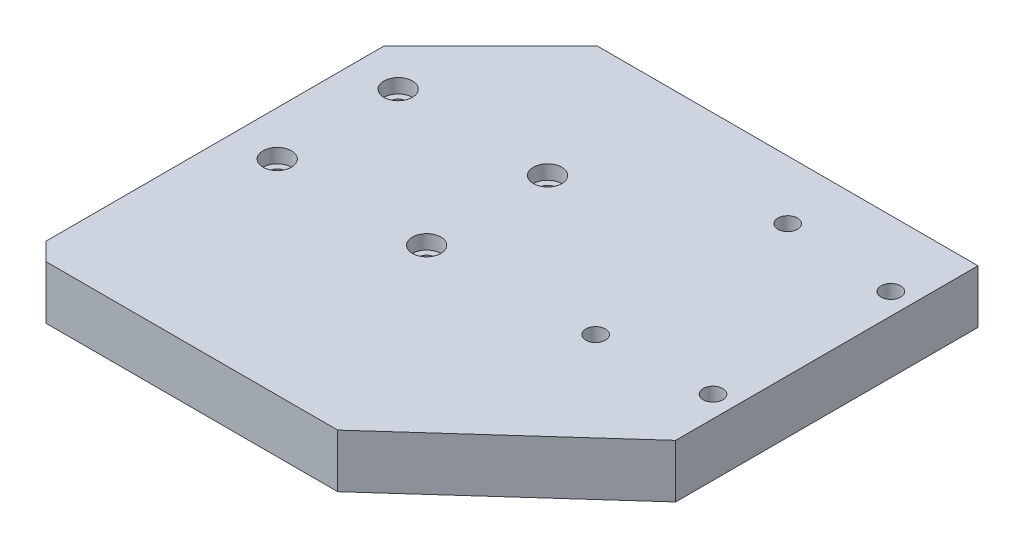
ISO-10303-21;
HEADER;
FILE_DESCRIPTION(('STEP AP214'),'2;1');
FILE_NAME('part.step','',(''),(''),'','','');
FILE_SCHEMA(('AUTOMOTIVE_DESIGN { 1 0 10303 214 1 1 1 1 }'));
ENDSEC;
DATA;
#1=APPLICATION_CONTEXT('core data for automotive mechanical design processes');
#2=APPLICATION_PROTOCOL_DEFINITION('international standard','automotive_design',2000,#1);
#3=PRODUCT_CONTEXT('',#1,'mechanical');
#4=PRODUCT('Part','Part','',(#3));
#5=PRODUCT_RELATED_PRODUCT_CATEGORY('part','',(#4));
#6=PRODUCT_DEFINITION_FORMATION('','',#4);
#7=PRODUCT_DEFINITION_CONTEXT('part definition',#1,'design');
#8=PRODUCT_DEFINITION('design','',#6,#7);
#9=PRODUCT_DEFINITION_SHAPE('','',#8);
#10=(LENGTH_UNIT() NAMED_UNIT(*) SI_UNIT(.MILLI.,.METRE.));
#11=(NAMED_UNIT(*) PLANE_ANGLE_UNIT() SI_UNIT($,.RADIAN.));
#12=(NAMED_UNIT(*) SI_UNIT($,.STERADIAN.) SOLID_ANGLE_UNIT());
#13=UNCERTAINTY_MEASURE_WITH_UNIT(LENGTH_MEASURE(1.E-05),#10,'distance_accuracy_value','');
#14=(GEOMETRIC_REPRESENTATION_CONTEXT(3) GLOBAL_UNCERTAINTY_ASSIGNED_CONTEXT((#13)) GLOBAL_UNIT_ASSIGNED_CONTEXT((#10,
#11,#12)) REPRESENTATION_CONTEXT('',''));
#15=CARTESIAN_POINT('',(0.,0.,0.));
#16=DIRECTION('',(0.,0.,1.));
#17=DIRECTION('',(1.,0.,0.));
#18=AXIS2_PLACEMENT_3D('',#15,#16,#17);
#19=CARTESIAN_POINT('',(0.,15.,-5.));
#20=DIRECTION('',(0.707106781186547,0.,-0.707106781186548));
#21=DIRECTION('',(-0.707106781186548,0.,-0.707106781186547));
#22=AXIS2_PLACEMENT_3D('',#19,#20,#21);
#23=PLANE('',#22);
#24=DIRECTION('',(0.707106781186548,0.,0.707106781186547));
#25=VECTOR('',#24,1.);
#26=CARTESIAN_POINT('',(0.,0.,-5.));
#27=LINE('',#26,#25);
#28=CARTESIAN_POINT('',(0.,0.,-5.));
#29=VERTEX_POINT('',#28);
#30=CARTESIAN_POINT('',(5.,0.,0.));
#31=VERTEX_POINT('',#30);
#32=EDGE_CURVE('E140',#29,#31,#27,.T.);
#33=ORIENTED_EDGE('',*,*,#32,.T.);
#34=DIRECTION('',(0.,-1.,0.));
#35=VECTOR('',#34,1.);
#36=CARTESIAN_POINT('',(5.,15.,0.));
#37=LINE('',#36,#35);
#38=CARTESIAN_POINT('',(5.,15.,0.));
#39=VERTEX_POINT('',#38);
#40=EDGE_CURVE('E11',#39,#31,#37,.T.);
#41=ORIENTED_EDGE('',*,*,#40,.F.);
#42=DIRECTION('',(0.707106781186548,0.,0.707106781186547));
#43=VECTOR('',#42,1.);
#44=CARTESIAN_POINT('',(0.,15.,-5.));
#45=LINE('',#44,#43);
#46=CARTESIAN_POINT('',(0.,15.,-5.));
#47=VERTEX_POINT('',#46);
#48=EDGE_CURVE('E154',#47,#39,#45,.T.);
#49=ORIENTED_EDGE('',*,*,#48,.F.);
#50=DIRECTION('',(0.,-1.,0.));
#51=VECTOR('',#50,1.);
#52=CARTESIAN_POINT('',(0.,15.,-5.));
#53=LINE('',#52,#51);
#54=EDGE_CURVE('E136',#47,#29,#53,.T.);
#55=ORIENTED_EDGE('',*,*,#54,.T.);
#56=EDGE_LOOP('',(#33,#41,#49,#55));
#57=FACE_BOUND('',#56,.T.);
#58=ADVANCED_FACE('F47',(#57),#23,.F.);
#59=CARTESIAN_POINT('',(5.,15.,0.));
#60=DIRECTION('',(0.,0.,-1.));
#61=DIRECTION('',(-1.,0.,0.));
#62=AXIS2_PLACEMENT_3D('',#59,#60,#61);
#63=PLANE('',#62);
#64=DIRECTION('',(1.,0.,0.));
#65=VECTOR('',#64,1.);
#66=CARTESIAN_POINT('',(5.,0.,0.));
#67=LINE('',#66,#65);
#68=CARTESIAN_POINT('',(87.,0.,0.));
#69=VERTEX_POINT('',#68);
#70=EDGE_CURVE('E143',#31,#69,#67,.T.);
#71=ORIENTED_EDGE('',*,*,#70,.T.);
#72=DIRECTION('',(0.,-1.,0.));
#73=VECTOR('',#72,1.);
#74=CARTESIAN_POINT('',(87.,15.,0.));
#75=LINE('',#74,#73);
#76=CARTESIAN_POINT('',(87.,15.,0.));
#77=VERTEX_POINT('',#76);
#78=EDGE_CURVE('E55',#77,#69,#75,.T.);
#79=ORIENTED_EDGE('',*,*,#78,.F.);
#80=DIRECTION('',(1.,0.,0.));
#81=VECTOR('',#80,1.);
#82=CARTESIAN_POINT('',(5.,15.,0.));
#83=LINE('',#82,#81);
#84=EDGE_CURVE('E104',#39,#77,#83,.T.);
#85=ORIENTED_EDGE('',*,*,#84,.F.);
#86=ORIENTED_EDGE('',*,*,#40,.T.);
#87=EDGE_LOOP('',(#71,#79,#85,#86));
#88=FACE_BOUND('',#87,.T.);
#89=ADVANCED_FACE('F286',(#88),#63,.F.);
#90=CARTESIAN_POINT('',(137.,15.,-45.));
#91=DIRECTION('',(-0.66896473162245,0.,-0.743294146247166));
#92=DIRECTION('',(-0.743294146247166,0.,0.66896473162245));
#93=AXIS2_PLACEMENT_3D('',#90,#91,#92);
#94=PLANE('',#93);
#95=DIRECTION('',(0.743294146247166,0.,-0.66896473162245));
#96=VECTOR('',#95,1.);
#97=CARTESIAN_POINT('',(137.,0.,-45.));
#98=LINE('',#97,#96);
#99=CARTESIAN_POINT('',(137.,0.,-45.));
#100=VERTEX_POINT('',#99);
#101=EDGE_CURVE('E146',#69,#100,#98,.T.);
#102=ORIENTED_EDGE('',*,*,#101,.T.);
#103=DIRECTION('',(0.,-1.,0.));
#104=VECTOR('',#103,1.);
#105=CARTESIAN_POINT('',(137.,15.,-45.));
#106=LINE('',#105,#104);
#107=CARTESIAN_POINT('',(137.,15.,-45.));
#108=VERTEX_POINT('',#107);
#109=EDGE_CURVE('E158',#108,#100,#106,.T.);
#110=ORIENTED_EDGE('',*,*,#109,.F.);
#111=DIRECTION('',(0.743294146247166,0.,-0.66896473162245));
#112=VECTOR('',#111,1.);
#113=CARTESIAN_POINT('',(137.,15.,-45.));
#114=LINE('',#113,#112);
#115=EDGE_CURVE('E166',#77,#108,#114,.T.);
#116=ORIENTED_EDGE('',*,*,#115,.F.);
#117=ORIENTED_EDGE('',*,*,#78,.T.);
#118=EDGE_LOOP('',(#102,#110,#116,#117));
#119=FACE_BOUND('',#118,.T.);
#120=ADVANCED_FACE('F164',(#119),#94,.F.);
#121=CARTESIAN_POINT('',(137.,15.,-130.));
#122=DIRECTION('',(-1.,0.,0.));
#123=DIRECTION('',(0.,0.,1.));
#124=AXIS2_PLACEMENT_3D('',#121,#122,#123);
#125=PLANE('',#124);
#126=DIRECTION('',(0.,0.,-1.));
#127=VECTOR('',#126,1.);
#128=CARTESIAN_POINT('',(137.,0.,-130.));
#129=LINE('',#128,#127);
#130=CARTESIAN_POINT('',(137.,0.,-130.));
#131=VERTEX_POINT('',#130);
#132=EDGE_CURVE('E149',#100,#131,#129,.T.);
#133=ORIENTED_EDGE('',*,*,#132,.T.);
#134=DIRECTION('',(0.,-1.,0.));
#135=VECTOR('',#134,1.);
#136=CARTESIAN_POINT('',(137.,15.,-130.));
#137=LINE('',#136,#135);
#138=CARTESIAN_POINT('',(137.,15.,-130.));
#139=VERTEX_POINT('',#138);
#140=EDGE_CURVE('E131',#139,#131,#137,.T.);
#141=ORIENTED_EDGE('',*,*,#140,.F.);
#142=DIRECTION('',(0.,0.,-1.));
#143=VECTOR('',#142,1.);
#144=CARTESIAN_POINT('',(137.,15.,-45.));
#145=LINE('',#144,#143);
#146=EDGE_CURVE('E122',#108,#139,#145,.T.);
#147=ORIENTED_EDGE('',*,*,#146,.F.);
#148=ORIENTED_EDGE('',*,*,#109,.T.);
#149=EDGE_LOOP('',(#133,#141,#147,#148));
#150=FACE_BOUND('',#149,.T.);
#151=ADVANCED_FACE('F171',(#150),#125,.F.);
#152=CARTESIAN_POINT('',(30.,15.,-130.));
#153=DIRECTION('',(0.,0.,1.));
#154=DIRECTION('',(1.,0.,0.));
#155=AXIS2_PLACEMENT_3D('',#152,#153,#154);
#156=PLANE('',#155);
#157=DIRECTION('',(-1.,0.,0.));
#158=VECTOR('',#157,1.);
#159=CARTESIAN_POINT('',(30.,0.,-130.));
#160=LINE('',#159,#158);
#161=CARTESIAN_POINT('',(30.,0.,-130.));
#162=VERTEX_POINT('',#161);
#163=EDGE_CURVE('E130',#131,#162,#160,.T.);
#164=ORIENTED_EDGE('',*,*,#163,.T.);
#165=DIRECTION('',(0.,-1.,0.));
#166=VECTOR('',#165,1.);
#167=CARTESIAN_POINT('',(30.,15.,-130.));
#168=LINE('',#167,#166);
#169=CARTESIAN_POINT('',(30.,15.,-130.));
#170=VERTEX_POINT('',#169);
#171=EDGE_CURVE('E127',#170,#162,#168,.T.);
#172=ORIENTED_EDGE('',*,*,#171,.F.);
#173=DIRECTION('',(-1.,0.,0.));
#174=VECTOR('',#173,1.);
#175=CARTESIAN_POINT('',(30.,15.,-130.));
#176=LINE('',#175,#174);
#177=EDGE_CURVE('E116',#139,#170,#176,.T.);
#178=ORIENTED_EDGE('',*,*,#177,.F.);
#179=ORIENTED_EDGE('',*,*,#140,.T.);
#180=EDGE_LOOP('',(#164,#172,#178,#179));
#181=FACE_BOUND('',#180,.T.);
#182=ADVANCED_FACE('F128',(#181),#156,.F.);
#183=CARTESIAN_POINT('',(0.,15.,-100.));
#184=DIRECTION('',(0.707106781186547,0.,0.707106781186547));
#185=DIRECTION('',(0.707106781186548,0.,-0.707106781186548));
#186=AXIS2_PLACEMENT_3D('',#183,#184,#185);
#187=PLANE('',#186);
#188=DIRECTION('',(-0.707106781186547,0.,0.707106781186547));
#189=VECTOR('',#188,1.);
#190=CARTESIAN_POINT('',(0.,0.,-100.));
#191=LINE('',#190,#189);
#192=CARTESIAN_POINT('',(0.,0.,-100.));
#193=VERTEX_POINT('',#192);
#194=EDGE_CURVE('E90',#162,#193,#191,.T.);
#195=ORIENTED_EDGE('',*,*,#194,.T.);
#196=DIRECTION('',(0.,-1.,0.));
#197=VECTOR('',#196,1.);
#198=CARTESIAN_POINT('',(0.,15.,-100.));
#199=LINE('',#198,#197);
#200=CARTESIAN_POINT('',(0.,15.,-100.));
#201=VERTEX_POINT('',#200);
#202=EDGE_CURVE('E132',#201,#193,#199,.T.);
#203=ORIENTED_EDGE('',*,*,#202,.F.);
#204=DIRECTION('',(-0.707106781186547,0.,0.707106781186547));
#205=VECTOR('',#204,1.);
#206=CARTESIAN_POINT('',(0.,15.,-100.));
#207=LINE('',#206,#205);
#208=EDGE_CURVE('E120',#170,#201,#207,.T.);
#209=ORIENTED_EDGE('',*,*,#208,.F.);
#210=ORIENTED_EDGE('',*,*,#171,.T.);
#211=EDGE_LOOP('',(#195,#203,#209,#210));
#212=FACE_BOUND('',#211,.T.);
#213=ADVANCED_FACE('F134',(#212),#187,.F.);
#214=CARTESIAN_POINT('',(0.,15.,-5.));
#215=DIRECTION('',(1.,0.,0.));
#216=DIRECTION('',(0.,0.,-1.));
#217=AXIS2_PLACEMENT_3D('',#214,#215,#216);
#218=PLANE('',#217);
#219=CARTESIAN_POINT('',(0.,7.5,-50.));
#220=DIRECTION('',(-1.,0.,0.));
#221=DIRECTION('',(0.,0.,1.));
#222=AXIS2_PLACEMENT_3D('',#219,#220,#221);
#223=CIRCLE('',#222,2.09999999999999);
#224=CARTESIAN_POINT('',(0.,7.5,-47.9));
#225=VERTEX_POINT('',#224);
#226=EDGE_CURVE('E256',#225,#225,#223,.T.);
#227=ORIENTED_EDGE('',*,*,#226,.F.);
#228=EDGE_LOOP('',(#227));
#229=FACE_BOUND('',#228,.T.);
#230=CARTESIAN_POINT('',(0.,7.5,-20.));
#231=DIRECTION('',(-1.,0.,0.));
#232=DIRECTION('',(0.,0.,1.));
#233=AXIS2_PLACEMENT_3D('',#230,#231,#232);
#234=CIRCLE('',#233,2.09999999999999);
#235=CARTESIAN_POINT('',(0.,7.5,-17.9));
#236=VERTEX_POINT('',#235);
#237=EDGE_CURVE('E250',#236,#236,#234,.T.);
#238=ORIENTED_EDGE('',*,*,#237,.F.);
#239=EDGE_LOOP('',(#238));
#240=FACE_BOUND('',#239,.T.);
#241=DIRECTION('',(0.,0.,1.));
#242=VECTOR('',#241,1.);
#243=CARTESIAN_POINT('',(0.,0.,-5.));
#244=LINE('',#243,#242);
#245=EDGE_CURVE('E96',#193,#29,#244,.T.);
#246=ORIENTED_EDGE('',*,*,#245,.T.);
#247=ORIENTED_EDGE('',*,*,#54,.F.);
#248=DIRECTION('',(0.,0.,1.));
#249=VECTOR('',#248,1.);
#250=CARTESIAN_POINT('',(0.,15.,-5.));
#251=LINE('',#250,#249);
#252=EDGE_CURVE('E63',#201,#47,#251,.T.);
#253=ORIENTED_EDGE('',*,*,#252,.F.);
#254=ORIENTED_EDGE('',*,*,#202,.T.);
#255=EDGE_LOOP('',(#246,#247,#253,#254));
#256=FACE_BOUND('',#255,.T.);
#257=ADVANCED_FACE('F262',(#229,#240,#256),#218,.F.);
#258=CARTESIAN_POINT('',(-47.5,15.,-52.5));
#259=DIRECTION('',(0.,1.,0.));
#260=DIRECTION('',(0.,0.,1.));
#261=AXIS2_PLACEMENT_3D('',#258,#259,#260);
#262=PLANE('',#261);
#263=CARTESIAN_POINT('',(12.5,15.,-91.5));
#264=DIRECTION('',(0.,1.,0.));
#265=DIRECTION('',(0.,0.,1.));
#266=AXIS2_PLACEMENT_3D('',#263,#264,#265);
#267=CIRCLE('',#266,4.);
#268=CARTESIAN_POINT('',(12.5,15.,-87.5));
#269=VERTEX_POINT('',#268);
#270=EDGE_CURVE('E244',#269,#269,#267,.T.);
#271=ORIENTED_EDGE('',*,*,#270,.F.);
#272=EDGE_LOOP('',(#271));
#273=FACE_BOUND('',#272,.T.);
#274=CARTESIAN_POINT('',(12.5,15.,-57.5));
#275=DIRECTION('',(0.,1.,0.));
#276=DIRECTION('',(0.,0.,1.));
#277=AXIS2_PLACEMENT_3D('',#274,#275,#276);
#278=CIRCLE('',#277,4.);
#279=CARTESIAN_POINT('',(12.5,15.,-53.5));
#280=VERTEX_POINT('',#279);
#281=EDGE_CURVE('E232',#280,#280,#278,.T.);
#282=ORIENTED_EDGE('',*,*,#281,.F.);
#283=EDGE_LOOP('',(#282));
#284=FACE_BOUND('',#283,.T.);
#285=CARTESIAN_POINT('',(54.5,15.,-57.5));
#286=DIRECTION('',(0.,1.,0.));
#287=DIRECTION('',(0.,0.,1.));
#288=AXIS2_PLACEMENT_3D('',#285,#286,#287);
#289=CIRCLE('',#288,4.);
#290=CARTESIAN_POINT('',(54.5,15.,-53.5));
#291=VERTEX_POINT('',#290);
#292=EDGE_CURVE('E220',#291,#291,#289,.T.);
#293=ORIENTED_EDGE('',*,*,#292,.F.);
#294=EDGE_LOOP('',(#293));
#295=FACE_BOUND('',#294,.T.);
#296=CARTESIAN_POINT('',(54.5,15.,-91.5));
#297=DIRECTION('',(0.,1.,0.));
#298=DIRECTION('',(0.,0.,1.));
#299=AXIS2_PLACEMENT_3D('',#296,#297,#298);
#300=CIRCLE('',#299,4.);
#301=CARTESIAN_POINT('',(54.5,15.,-87.5));
#302=VERTEX_POINT('',#301);
#303=EDGE_CURVE('E208',#302,#302,#300,.T.);
#304=ORIENTED_EDGE('',*,*,#303,.F.);
#305=EDGE_LOOP('',(#304));
#306=FACE_BOUND('',#305,.T.);
#307=CARTESIAN_POINT('',(131.,15.,-111.5));
#308=DIRECTION('',(0.,1.,0.));
#309=DIRECTION('',(0.,0.,1.));
#310=AXIS2_PLACEMENT_3D('',#307,#308,#309);
#311=CIRCLE('',#310,2.75);
#312=CARTESIAN_POINT('',(131.,15.,-108.75));
#313=VERTEX_POINT('',#312);
#314=EDGE_CURVE('E196',#313,#313,#311,.T.);
#315=ORIENTED_EDGE('',*,*,#314,.F.);
#316=EDGE_LOOP('',(#315));
#317=FACE_BOUND('',#316,.T.);
#318=CARTESIAN_POINT('',(131.,15.,-61.5));
#319=DIRECTION('',(0.,1.,0.));
#320=DIRECTION('',(0.,0.,1.));
#321=AXIS2_PLACEMENT_3D('',#318,#319,#320);
#322=CIRCLE('',#321,2.75);
#323=CARTESIAN_POINT('',(131.,15.,-58.75));
#324=VERTEX_POINT('',#323);
#325=EDGE_CURVE('E190',#324,#324,#322,.T.);
#326=ORIENTED_EDGE('',*,*,#325,.F.);
#327=EDGE_LOOP('',(#326));
#328=FACE_BOUND('',#327,.T.);
#329=CARTESIAN_POINT('',(100.,15.,-59.5));
#330=DIRECTION('',(0.,1.,0.));
#331=DIRECTION('',(0.,0.,1.));
#332=AXIS2_PLACEMENT_3D('',#329,#330,#331);
#333=CIRCLE('',#332,2.75);
#334=CARTESIAN_POINT('',(100.,15.,-56.75));
#335=VERTEX_POINT('',#334);
#336=EDGE_CURVE('E184',#335,#335,#333,.T.);
#337=ORIENTED_EDGE('',*,*,#336,.F.);
#338=EDGE_LOOP('',(#337));
#339=FACE_BOUND('',#338,.T.);
#340=CARTESIAN_POINT('',(99.9999999999994,15.,-113.5));
#341=DIRECTION('',(0.,1.,0.));
#342=DIRECTION('',(0.,0.,1.));
#343=AXIS2_PLACEMENT_3D('',#340,#341,#342);
#344=CIRCLE('',#343,2.75);
#345=CARTESIAN_POINT('',(99.9999999999994,15.,-110.75));
#346=VERTEX_POINT('',#345);
#347=EDGE_CURVE('E178',#346,#346,#344,.T.);
#348=ORIENTED_EDGE('',*,*,#347,.F.);
#349=EDGE_LOOP('',(#348));
#350=FACE_BOUND('',#349,.T.);
#351=ORIENTED_EDGE('',*,*,#48,.T.);
#352=ORIENTED_EDGE('',*,*,#84,.T.);
#353=ORIENTED_EDGE('',*,*,#115,.T.);
#354=ORIENTED_EDGE('',*,*,#146,.T.);
#355=ORIENTED_EDGE('',*,*,#177,.T.);
#356=ORIENTED_EDGE('',*,*,#208,.T.);
#357=ORIENTED_EDGE('',*,*,#252,.T.);
#358=EDGE_LOOP('',(#351,#352,#353,#354,#355,#356,#357));
#359=FACE_BOUND('',#358,.T.);
#360=ADVANCED_FACE('F118',(#273,#284,#295,#306,#317,#328,#339,#350,#359),#262,.T.);
#361=CARTESIAN_POINT('',(-47.5,0.,-52.5));
#362=DIRECTION('',(0.,1.,0.));
#363=DIRECTION('',(0.,0.,1.));
#364=AXIS2_PLACEMENT_3D('',#361,#362,#363);
#365=PLANE('',#364);
#366=CARTESIAN_POINT('',(12.5,0.,-91.5));
#367=DIRECTION('',(0.,1.,0.));
#368=DIRECTION('',(0.,0.,1.));
#369=AXIS2_PLACEMENT_3D('',#366,#367,#368);
#370=CIRCLE('',#369,2.25);
#371=CARTESIAN_POINT('',(12.5,0.,-89.25));
#372=VERTEX_POINT('',#371);
#373=EDGE_CURVE('E235',#372,#372,#370,.T.);
#374=ORIENTED_EDGE('',*,*,#373,.T.);
#375=EDGE_LOOP('',(#374));
#376=FACE_BOUND('',#375,.T.);
#377=CARTESIAN_POINT('',(12.5,0.,-57.5));
#378=DIRECTION('',(0.,1.,0.));
#379=DIRECTION('',(0.,0.,1.));
#380=AXIS2_PLACEMENT_3D('',#377,#378,#379);
#381=CIRCLE('',#380,2.25);
#382=CARTESIAN_POINT('',(12.5,0.,-55.25));
#383=VERTEX_POINT('',#382);
#384=EDGE_CURVE('E223',#383,#383,#381,.T.);
#385=ORIENTED_EDGE('',*,*,#384,.T.);
#386=EDGE_LOOP('',(#385));
#387=FACE_BOUND('',#386,.T.);
#388=CARTESIAN_POINT('',(54.5,0.,-57.5));
#389=DIRECTION('',(0.,1.,0.));
#390=DIRECTION('',(0.,0.,1.));
#391=AXIS2_PLACEMENT_3D('',#388,#389,#390);
#392=CIRCLE('',#391,2.25);
#393=CARTESIAN_POINT('',(54.5,0.,-55.25));
#394=VERTEX_POINT('',#393);
#395=EDGE_CURVE('E211',#394,#394,#392,.T.);
#396=ORIENTED_EDGE('',*,*,#395,.T.);
#397=EDGE_LOOP('',(#396));
#398=FACE_BOUND('',#397,.T.);
#399=CARTESIAN_POINT('',(54.5,0.,-91.5));
#400=DIRECTION('',(0.,1.,0.));
#401=DIRECTION('',(0.,0.,1.));
#402=AXIS2_PLACEMENT_3D('',#399,#400,#401);
#403=CIRCLE('',#402,2.25);
#404=CARTESIAN_POINT('',(54.5,0.,-89.25));
#405=VERTEX_POINT('',#404);
#406=EDGE_CURVE('E199',#405,#405,#403,.T.);
#407=ORIENTED_EDGE('',*,*,#406,.T.);
#408=EDGE_LOOP('',(#407));
#409=FACE_BOUND('',#408,.T.);
#410=CARTESIAN_POINT('',(131.,0.,-111.5));
#411=DIRECTION('',(0.,1.,0.));
#412=DIRECTION('',(0.,0.,1.));
#413=AXIS2_PLACEMENT_3D('',#410,#411,#412);
#414=CIRCLE('',#413,2.75);
#415=CARTESIAN_POINT('',(131.,0.,-108.75));
#416=VERTEX_POINT('',#415);
#417=EDGE_CURVE('E193',#416,#416,#414,.T.);
#418=ORIENTED_EDGE('',*,*,#417,.T.);
#419=EDGE_LOOP('',(#418));
#420=FACE_BOUND('',#419,.T.);
#421=CARTESIAN_POINT('',(131.,0.,-61.5));
#422=DIRECTION('',(0.,1.,0.));
#423=DIRECTION('',(0.,0.,1.));
#424=AXIS2_PLACEMENT_3D('',#421,#422,#423);
#425=CIRCLE('',#424,2.75);
#426=CARTESIAN_POINT('',(131.,0.,-58.75));
#427=VERTEX_POINT('',#426);
#428=EDGE_CURVE('E187',#427,#427,#425,.T.);
#429=ORIENTED_EDGE('',*,*,#428,.T.);
#430=EDGE_LOOP('',(#429));
#431=FACE_BOUND('',#430,.T.);
#432=CARTESIAN_POINT('',(100.,0.,-59.5));
#433=DIRECTION('',(0.,1.,0.));
#434=DIRECTION('',(0.,0.,1.));
#435=AXIS2_PLACEMENT_3D('',#432,#433,#434);
#436=CIRCLE('',#435,2.75);
#437=CARTESIAN_POINT('',(100.,0.,-56.75));
#438=VERTEX_POINT('',#437);
#439=EDGE_CURVE('E181',#438,#438,#436,.T.);
#440=ORIENTED_EDGE('',*,*,#439,.T.);
#441=EDGE_LOOP('',(#440));
#442=FACE_BOUND('',#441,.T.);
#443=CARTESIAN_POINT('',(99.9999999999994,0.,-113.5));
#444=DIRECTION('',(0.,1.,0.));
#445=DIRECTION('',(0.,0.,1.));
#446=AXIS2_PLACEMENT_3D('',#443,#444,#445);
#447=CIRCLE('',#446,2.75);
#448=CARTESIAN_POINT('',(99.9999999999994,0.,-110.75));
#449=VERTEX_POINT('',#448);
#450=EDGE_CURVE('E144',#449,#449,#447,.T.);
#451=ORIENTED_EDGE('',*,*,#450,.T.);
#452=EDGE_LOOP('',(#451));
#453=FACE_BOUND('',#452,.T.);
#454=ORIENTED_EDGE('',*,*,#32,.F.);
#455=ORIENTED_EDGE('',*,*,#245,.F.);
#456=ORIENTED_EDGE('',*,*,#194,.F.);
#457=ORIENTED_EDGE('',*,*,#163,.F.);
#458=ORIENTED_EDGE('',*,*,#132,.F.);
#459=ORIENTED_EDGE('',*,*,#101,.F.);
#460=ORIENTED_EDGE('',*,*,#70,.F.);
#461=EDGE_LOOP('',(#454,#455,#456,#457,#458,#459,#460));
#462=FACE_BOUND('',#461,.T.);
#463=ADVANCED_FACE('F169',(#376,#387,#398,#409,#420,#431,#442,#453,#462),#365,.F.);
#464=CARTESIAN_POINT('',(99.9999999999994,15.,-113.5));
#465=DIRECTION('',(0.,1.,0.));
#466=DIRECTION('',(0.,0.,1.));
#467=AXIS2_PLACEMENT_3D('',#464,#465,#466);
#468=CYLINDRICAL_SURFACE('',#467,2.75);
#469=ORIENTED_EDGE('',*,*,#450,.F.);
#470=EDGE_LOOP('',(#469));
#471=FACE_BOUND('',#470,.T.);
#472=ORIENTED_EDGE('',*,*,#347,.T.);
#473=EDGE_LOOP('',(#472));
#474=FACE_BOUND('',#473,.T.);
#475=ADVANCED_FACE('F306',(#471,#474),#468,.F.);
#476=CARTESIAN_POINT('',(100.,15.,-59.5));
#477=DIRECTION('',(0.,1.,0.));
#478=DIRECTION('',(0.,0.,1.));
#479=AXIS2_PLACEMENT_3D('',#476,#477,#478);
#480=CYLINDRICAL_SURFACE('',#479,2.75);
#481=ORIENTED_EDGE('',*,*,#439,.F.);
#482=EDGE_LOOP('',(#481));
#483=FACE_BOUND('',#482,.T.);
#484=ORIENTED_EDGE('',*,*,#336,.T.);
#485=EDGE_LOOP('',(#484));
#486=FACE_BOUND('',#485,.T.);
#487=ADVANCED_FACE('F313',(#483,#486),#480,.F.);
#488=CARTESIAN_POINT('',(131.,15.,-61.5));
#489=DIRECTION('',(0.,1.,0.));
#490=DIRECTION('',(0.,0.,1.));
#491=AXIS2_PLACEMENT_3D('',#488,#489,#490);
#492=CYLINDRICAL_SURFACE('',#491,2.75);
#493=ORIENTED_EDGE('',*,*,#428,.F.);
#494=EDGE_LOOP('',(#493));
#495=FACE_BOUND('',#494,.T.);
#496=ORIENTED_EDGE('',*,*,#325,.T.);
#497=EDGE_LOOP('',(#496));
#498=FACE_BOUND('',#497,.T.);
#499=ADVANCED_FACE('F317',(#495,#498),#492,.F.);
#500=CARTESIAN_POINT('',(131.,15.,-111.5));
#501=DIRECTION('',(0.,1.,0.));
#502=DIRECTION('',(0.,0.,1.));
#503=AXIS2_PLACEMENT_3D('',#500,#501,#502);
#504=CYLINDRICAL_SURFACE('',#503,2.75);
#505=ORIENTED_EDGE('',*,*,#417,.F.);
#506=EDGE_LOOP('',(#505));
#507=FACE_BOUND('',#506,.T.);
#508=ORIENTED_EDGE('',*,*,#314,.T.);
#509=EDGE_LOOP('',(#508));
#510=FACE_BOUND('',#509,.T.);
#511=ADVANCED_FACE('F321',(#507,#510),#504,.F.);
#512=CARTESIAN_POINT('',(54.5,15.,-91.5));
#513=DIRECTION('',(0.,1.,0.));
#514=DIRECTION('',(0.,0.,1.));
#515=AXIS2_PLACEMENT_3D('',#512,#513,#514);
#516=CYLINDRICAL_SURFACE('',#515,2.25);
#517=ORIENTED_EDGE('',*,*,#406,.F.);
#518=EDGE_LOOP('',(#517));
#519=FACE_BOUND('',#518,.T.);
#520=CARTESIAN_POINT('',(54.5,11.,-91.5));
#521=DIRECTION('',(0.,1.,0.));
#522=DIRECTION('',(0.,0.,1.));
#523=AXIS2_PLACEMENT_3D('',#520,#521,#522);
#524=CIRCLE('',#523,2.25);
#525=CARTESIAN_POINT('',(54.5,11.,-89.25));
#526=VERTEX_POINT('',#525);
#527=EDGE_CURVE('E202',#526,#526,#524,.T.);
#528=ORIENTED_EDGE('',*,*,#527,.T.);
#529=EDGE_LOOP('',(#528));
#530=FACE_BOUND('',#529,.T.);
#531=ADVANCED_FACE('F325',(#519,#530),#516,.F.);
#532=CARTESIAN_POINT('',(56.75,11.,-91.5));
#533=DIRECTION('',(0.,-1.,0.));
#534=DIRECTION('',(0.,0.,-1.));
#535=AXIS2_PLACEMENT_3D('',#532,#533,#534);
#536=PLANE('',#535);
#537=ORIENTED_EDGE('',*,*,#527,.F.);
#538=EDGE_LOOP('',(#537));
#539=FACE_BOUND('',#538,.T.);
#540=CARTESIAN_POINT('',(54.5,11.,-91.5));
#541=DIRECTION('',(0.,1.,0.));
#542=DIRECTION('',(0.,0.,1.));
#543=AXIS2_PLACEMENT_3D('',#540,#541,#542);
#544=CIRCLE('',#543,4.);
#545=CARTESIAN_POINT('',(54.5,11.,-87.5));
#546=VERTEX_POINT('',#545);
#547=EDGE_CURVE('E205',#546,#546,#544,.T.);
#548=ORIENTED_EDGE('',*,*,#547,.T.);
#549=EDGE_LOOP('',(#548));
#550=FACE_BOUND('',#549,.T.);
#551=ADVANCED_FACE('F329',(#539,#550),#536,.F.);
#552=CARTESIAN_POINT('',(54.5,15.,-91.5));
#553=DIRECTION('',(0.,1.,0.));
#554=DIRECTION('',(0.,0.,1.));
#555=AXIS2_PLACEMENT_3D('',#552,#553,#554);
#556=CYLINDRICAL_SURFACE('',#555,4.);
#557=ORIENTED_EDGE('',*,*,#547,.F.);
#558=EDGE_LOOP('',(#557));
#559=FACE_BOUND('',#558,.T.);
#560=ORIENTED_EDGE('',*,*,#303,.T.);
#561=EDGE_LOOP('',(#560));
#562=FACE_BOUND('',#561,.T.);
#563=ADVANCED_FACE('F333',(#559,#562),#556,.F.);
#564=CARTESIAN_POINT('',(54.5,15.,-57.5));
#565=DIRECTION('',(0.,1.,0.));
#566=DIRECTION('',(0.,0.,1.));
#567=AXIS2_PLACEMENT_3D('',#564,#565,#566);
#568=CYLINDRICAL_SURFACE('',#567,2.25);
#569=ORIENTED_EDGE('',*,*,#395,.F.);
#570=EDGE_LOOP('',(#569));
#571=FACE_BOUND('',#570,.T.);
#572=CARTESIAN_POINT('',(54.5,11.,-57.5));
#573=DIRECTION('',(0.,1.,0.));
#574=DIRECTION('',(0.,0.,1.));
#575=AXIS2_PLACEMENT_3D('',#572,#573,#574);
#576=CIRCLE('',#575,2.25);
#577=CARTESIAN_POINT('',(54.5,11.,-55.25));
#578=VERTEX_POINT('',#577);
#579=EDGE_CURVE('E214',#578,#578,#576,.T.);
#580=ORIENTED_EDGE('',*,*,#579,.T.);
#581=EDGE_LOOP('',(#580));
#582=FACE_BOUND('',#581,.T.);
#583=ADVANCED_FACE('F337',(#571,#582),#568,.F.);
#584=CARTESIAN_POINT('',(56.75,11.,-57.5));
#585=DIRECTION('',(0.,-1.,0.));
#586=DIRECTION('',(0.,0.,-1.));
#587=AXIS2_PLACEMENT_3D('',#584,#585,#586);
#588=PLANE('',#587);
#589=ORIENTED_EDGE('',*,*,#579,.F.);
#590=EDGE_LOOP('',(#589));
#591=FACE_BOUND('',#590,.T.);
#592=CARTESIAN_POINT('',(54.5,11.,-57.5));
#593=DIRECTION('',(0.,1.,0.));
#594=DIRECTION('',(0.,0.,1.));
#595=AXIS2_PLACEMENT_3D('',#592,#593,#594);
#596=CIRCLE('',#595,4.);
#597=CARTESIAN_POINT('',(54.5,11.,-53.5));
#598=VERTEX_POINT('',#597);
#599=EDGE_CURVE('E217',#598,#598,#596,.T.);
#600=ORIENTED_EDGE('',*,*,#599,.T.);
#601=EDGE_LOOP('',(#600));
#602=FACE_BOUND('',#601,.T.);
#603=ADVANCED_FACE('F341',(#591,#602),#588,.F.);
#604=CARTESIAN_POINT('',(54.5,15.,-57.5));
#605=DIRECTION('',(0.,1.,0.));
#606=DIRECTION('',(0.,0.,1.));
#607=AXIS2_PLACEMENT_3D('',#604,#605,#606);
#608=CYLINDRICAL_SURFACE('',#607,4.);
#609=ORIENTED_EDGE('',*,*,#599,.F.);
#610=EDGE_LOOP('',(#609));
#611=FACE_BOUND('',#610,.T.);
#612=ORIENTED_EDGE('',*,*,#292,.T.);
#613=EDGE_LOOP('',(#612));
#614=FACE_BOUND('',#613,.T.);
#615=ADVANCED_FACE('F345',(#611,#614),#608,.F.);
#616=CARTESIAN_POINT('',(12.5,15.,-57.5));
#617=DIRECTION('',(0.,1.,0.));
#618=DIRECTION('',(0.,0.,1.));
#619=AXIS2_PLACEMENT_3D('',#616,#617,#618);
#620=CYLINDRICAL_SURFACE('',#619,2.25);
#621=ORIENTED_EDGE('',*,*,#384,.F.);
#622=EDGE_LOOP('',(#621));
#623=FACE_BOUND('',#622,.T.);
#624=CARTESIAN_POINT('',(12.5,11.,-57.5));
#625=DIRECTION('',(0.,1.,0.));
#626=DIRECTION('',(0.,0.,1.));
#627=AXIS2_PLACEMENT_3D('',#624,#625,#626);
#628=CIRCLE('',#627,2.25);
#629=CARTESIAN_POINT('',(12.5,11.,-55.25));
#630=VERTEX_POINT('',#629);
#631=EDGE_CURVE('E226',#630,#630,#628,.T.);
#632=ORIENTED_EDGE('',*,*,#631,.T.);
#633=EDGE_LOOP('',(#632));
#634=FACE_BOUND('',#633,.T.);
#635=ADVANCED_FACE('F349',(#623,#634),#620,.F.);
#636=CARTESIAN_POINT('',(14.75,11.,-57.5));
#637=DIRECTION('',(0.,-1.,0.));
#638=DIRECTION('',(0.,0.,-1.));
#639=AXIS2_PLACEMENT_3D('',#636,#637,#638);
#640=PLANE('',#639);
#641=ORIENTED_EDGE('',*,*,#631,.F.);
#642=EDGE_LOOP('',(#641));
#643=FACE_BOUND('',#642,.T.);
#644=CARTESIAN_POINT('',(12.5,11.,-57.5));
#645=DIRECTION('',(0.,1.,0.));
#646=DIRECTION('',(0.,0.,1.));
#647=AXIS2_PLACEMENT_3D('',#644,#645,#646);
#648=CIRCLE('',#647,4.);
#649=CARTESIAN_POINT('',(12.5,11.,-53.5));
#650=VERTEX_POINT('',#649);
#651=EDGE_CURVE('E229',#650,#650,#648,.T.);
#652=ORIENTED_EDGE('',*,*,#651,.T.);
#653=EDGE_LOOP('',(#652));
#654=FACE_BOUND('',#653,.T.);
#655=ADVANCED_FACE('F353',(#643,#654),#640,.F.);
#656=CARTESIAN_POINT('',(12.5,15.,-57.5));
#657=DIRECTION('',(0.,1.,0.));
#658=DIRECTION('',(0.,0.,1.));
#659=AXIS2_PLACEMENT_3D('',#656,#657,#658);
#660=CYLINDRICAL_SURFACE('',#659,4.);
#661=ORIENTED_EDGE('',*,*,#651,.F.);
#662=EDGE_LOOP('',(#661));
#663=FACE_BOUND('',#662,.T.);
#664=ORIENTED_EDGE('',*,*,#281,.T.);
#665=EDGE_LOOP('',(#664));
#666=FACE_BOUND('',#665,.T.);
#667=ADVANCED_FACE('F357',(#663,#666),#660,.F.);
#668=CARTESIAN_POINT('',(12.5,15.,-91.5));
#669=DIRECTION('',(0.,1.,0.));
#670=DIRECTION('',(0.,0.,1.));
#671=AXIS2_PLACEMENT_3D('',#668,#669,#670);
#672=CYLINDRICAL_SURFACE('',#671,2.25);
#673=ORIENTED_EDGE('',*,*,#373,.F.);
#674=EDGE_LOOP('',(#673));
#675=FACE_BOUND('',#674,.T.);
#676=CARTESIAN_POINT('',(12.5,11.,-91.5));
#677=DIRECTION('',(0.,1.,0.));
#678=DIRECTION('',(0.,0.,1.));
#679=AXIS2_PLACEMENT_3D('',#676,#677,#678);
#680=CIRCLE('',#679,2.25);
#681=CARTESIAN_POINT('',(12.5,11.,-89.25));
#682=VERTEX_POINT('',#681);
#683=EDGE_CURVE('E238',#682,#682,#680,.T.);
#684=ORIENTED_EDGE('',*,*,#683,.T.);
#685=EDGE_LOOP('',(#684));
#686=FACE_BOUND('',#685,.T.);
#687=ADVANCED_FACE('F361',(#675,#686),#672,.F.);
#688=CARTESIAN_POINT('',(14.75,11.,-91.5));
#689=DIRECTION('',(0.,-1.,0.));
#690=DIRECTION('',(0.,0.,-1.));
#691=AXIS2_PLACEMENT_3D('',#688,#689,#690);
#692=PLANE('',#691);
#693=ORIENTED_EDGE('',*,*,#683,.F.);
#694=EDGE_LOOP('',(#693));
#695=FACE_BOUND('',#694,.T.);
#696=CARTESIAN_POINT('',(12.5,11.,-91.5));
#697=DIRECTION('',(0.,1.,0.));
#698=DIRECTION('',(0.,0.,1.));
#699=AXIS2_PLACEMENT_3D('',#696,#697,#698);
#700=CIRCLE('',#699,4.);
#701=CARTESIAN_POINT('',(12.5,11.,-87.5));
#702=VERTEX_POINT('',#701);
#703=EDGE_CURVE('E241',#702,#702,#700,.T.);
#704=ORIENTED_EDGE('',*,*,#703,.T.);
#705=EDGE_LOOP('',(#704));
#706=FACE_BOUND('',#705,.T.);
#707=ADVANCED_FACE('F365',(#695,#706),#692,.F.);
#708=CARTESIAN_POINT('',(12.5,15.,-91.5));
#709=DIRECTION('',(0.,1.,0.));
#710=DIRECTION('',(0.,0.,1.));
#711=AXIS2_PLACEMENT_3D('',#708,#709,#710);
#712=CYLINDRICAL_SURFACE('',#711,4.);
#713=ORIENTED_EDGE('',*,*,#703,.F.);
#714=EDGE_LOOP('',(#713));
#715=FACE_BOUND('',#714,.T.);
#716=ORIENTED_EDGE('',*,*,#270,.T.);
#717=EDGE_LOOP('',(#716));
#718=FACE_BOUND('',#717,.T.);
#719=ADVANCED_FACE('F281',(#715,#718),#712,.F.);
#720=CARTESIAN_POINT('',(14.,7.5,-20.));
#721=DIRECTION('',(-1.,0.,0.));
#722=DIRECTION('',(0.,0.,1.));
#723=AXIS2_PLACEMENT_3D('',#720,#721,#722);
#724=CONICAL_SURFACE('',#723,2.09999999999999,1.02974425867665);
#725=CARTESIAN_POINT('',(15.2618072999579,7.5,-20.));
#726=VERTEX_POINT('',#725);
#727=VERTEX_LOOP('',#726);
#728=FACE_BOUND('',#727,.T.);
#729=CARTESIAN_POINT('',(14.,7.5,-20.));
#730=DIRECTION('',(-1.,0.,0.));
#731=DIRECTION('',(0.,0.,1.));
#732=AXIS2_PLACEMENT_3D('',#729,#730,#731);
#733=CIRCLE('',#732,2.09999999999999);
#734=CARTESIAN_POINT('',(14.,7.5,-17.9));
#735=VERTEX_POINT('',#734);
#736=EDGE_CURVE('E247',#735,#735,#733,.T.);
#737=ORIENTED_EDGE('',*,*,#736,.T.);
#738=EDGE_LOOP('',(#737));
#739=FACE_BOUND('',#738,.T.);
#740=ADVANCED_FACE('F271',(#728,#739),#724,.F.);
#741=CARTESIAN_POINT('',(0.,7.5,-20.));
#742=DIRECTION('',(-1.,0.,0.));
#743=DIRECTION('',(0.,0.,1.));
#744=AXIS2_PLACEMENT_3D('',#741,#742,#743);
#745=CYLINDRICAL_SURFACE('',#744,2.09999999999999);
#746=ORIENTED_EDGE('',*,*,#736,.F.);
#747=EDGE_LOOP('',(#746));
#748=FACE_BOUND('',#747,.T.);
#749=ORIENTED_EDGE('',*,*,#237,.T.);
#750=EDGE_LOOP('',(#749));
#751=FACE_BOUND('',#750,.T.);
#752=ADVANCED_FACE('F268',(#748,#751),#745,.F.);
#753=CARTESIAN_POINT('',(14.,7.5,-50.));
#754=DIRECTION('',(-1.,0.,0.));
#755=DIRECTION('',(0.,0.,1.));
#756=AXIS2_PLACEMENT_3D('',#753,#754,#755);
#757=CONICAL_SURFACE('',#756,2.09999999999999,1.02974425867665);
#758=CARTESIAN_POINT('',(15.2618072999579,7.5,-50.));
#759=VERTEX_POINT('',#758);
#760=VERTEX_LOOP('',#759);
#761=FACE_BOUND('',#760,.T.);
#762=CARTESIAN_POINT('',(14.,7.5,-50.));
#763=DIRECTION('',(-1.,0.,0.));
#764=DIRECTION('',(0.,0.,1.));
#765=AXIS2_PLACEMENT_3D('',#762,#763,#764);
#766=CIRCLE('',#765,2.09999999999999);
#767=CARTESIAN_POINT('',(14.,7.5,-47.9));
#768=VERTEX_POINT('',#767);
#769=EDGE_CURVE('E253',#768,#768,#766,.T.);
#770=ORIENTED_EDGE('',*,*,#769,.T.);
#771=EDGE_LOOP('',(#770));
#772=FACE_BOUND('',#771,.T.);
#773=ADVANCED_FACE('F270',(#761,#772),#757,.F.);
#774=CARTESIAN_POINT('',(0.,7.5,-50.));
#775=DIRECTION('',(-1.,0.,0.));
#776=DIRECTION('',(0.,0.,1.));
#777=AXIS2_PLACEMENT_3D('',#774,#775,#776);
#778=CYLINDRICAL_SURFACE('',#777,2.09999999999999);
#779=ORIENTED_EDGE('',*,*,#769,.F.);
#780=EDGE_LOOP('',(#779));
#781=FACE_BOUND('',#780,.T.);
#782=ORIENTED_EDGE('',*,*,#226,.T.);
#783=EDGE_LOOP('',(#782));
#784=FACE_BOUND('',#783,.T.);
#785=ADVANCED_FACE('F260',(#781,#784),#778,.F.);
#786=CLOSED_SHELL('',(#58,#89,#120,#151,#182,#213,#257,#360,#463,#475,#487,#499,#511,#531,#551,
#563,#583,#603,#615,#635,#655,#667,#687,#707,#719,#740,#752,#773,#785));
#787=MANIFOLD_SOLID_BREP('B2',#786);
#788=ADVANCED_BREP_SHAPE_REPRESENTATION('',(#18,#787),#14);
#789=SHAPE_DEFINITION_REPRESENTATION(#9,#788);
ENDSEC;
END-ISO-10303-21;
